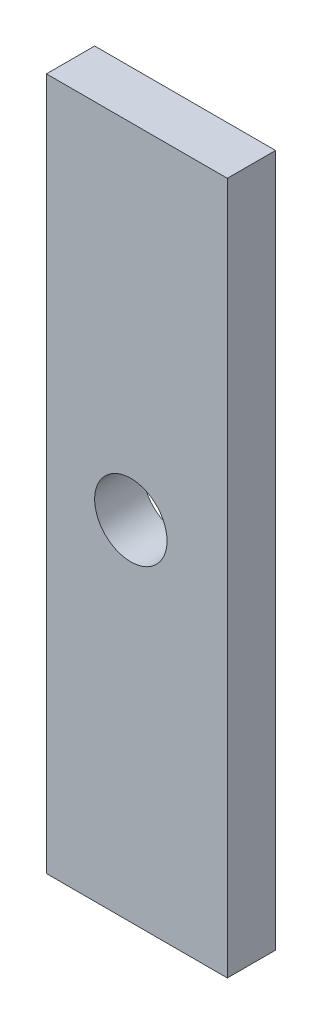
ISO-10303-21;
HEADER;
FILE_DESCRIPTION(('STEP AP214'),'2;1');
FILE_NAME('part.step','',(''),(''),'','','');
FILE_SCHEMA(('AUTOMOTIVE_DESIGN { 1 0 10303 214 1 1 1 1 }'));
ENDSEC;
DATA;
#1=APPLICATION_CONTEXT('core data for automotive mechanical design processes');
#2=APPLICATION_PROTOCOL_DEFINITION('international standard','automotive_design',2000,#1);
#3=PRODUCT_CONTEXT('',#1,'mechanical');
#4=PRODUCT('Part','Part','',(#3));
#5=PRODUCT_RELATED_PRODUCT_CATEGORY('part','',(#4));
#6=PRODUCT_DEFINITION_FORMATION('','',#4);
#7=PRODUCT_DEFINITION_CONTEXT('part definition',#1,'design');
#8=PRODUCT_DEFINITION('design','',#6,#7);
#9=PRODUCT_DEFINITION_SHAPE('','',#8);
#10=(LENGTH_UNIT() NAMED_UNIT(*) SI_UNIT(.MILLI.,.METRE.));
#11=(NAMED_UNIT(*) PLANE_ANGLE_UNIT() SI_UNIT($,.RADIAN.));
#12=(NAMED_UNIT(*) SI_UNIT($,.STERADIAN.) SOLID_ANGLE_UNIT());
#13=UNCERTAINTY_MEASURE_WITH_UNIT(LENGTH_MEASURE(1.E-05),#10,'distance_accuracy_value','');
#14=(GEOMETRIC_REPRESENTATION_CONTEXT(3) GLOBAL_UNCERTAINTY_ASSIGNED_CONTEXT((#13)) GLOBAL_UNIT_ASSIGNED_CONTEXT((#10,
#11,#12)) REPRESENTATION_CONTEXT('',''));
#15=CARTESIAN_POINT('',(0.,0.,0.));
#16=DIRECTION('',(0.,0.,1.));
#17=DIRECTION('',(1.,0.,0.));
#18=AXIS2_PLACEMENT_3D('',#15,#16,#17);
#19=CARTESIAN_POINT('',(0.,0.,2.));
#20=DIRECTION('',(0.,0.,-1.));
#21=DIRECTION('',(-1.,0.,0.));
#22=AXIS2_PLACEMENT_3D('',#19,#20,#21);
#23=PLANE('',#22);
#24=DIRECTION('',(0.,1.,0.));
#25=VECTOR('',#24,1.);
#26=CARTESIAN_POINT('',(4.,-14.441,2.));
#27=LINE('',#26,#25);
#28=CARTESIAN_POINT('',(4.,-14.441,2.));
#29=VERTEX_POINT('',#28);
#30=CARTESIAN_POINT('',(4.,14.2719690936802,2.));
#31=VERTEX_POINT('',#30);
#32=EDGE_CURVE('E85',#29,#31,#27,.T.);
#33=ORIENTED_EDGE('',*,*,#32,.T.);
#34=DIRECTION('',(-1.,0.,0.));
#35=VECTOR('',#34,1.);
#36=CARTESIAN_POINT('',(-3.5,14.2719690936802,2.));
#37=LINE('',#36,#35);
#38=CARTESIAN_POINT('',(-3.5,14.2719690936802,2.));
#39=VERTEX_POINT('',#38);
#40=EDGE_CURVE('E80',#31,#39,#37,.T.);
#41=ORIENTED_EDGE('',*,*,#40,.T.);
#42=DIRECTION('',(0.,-1.,0.));
#43=VECTOR('',#42,1.);
#44=CARTESIAN_POINT('',(-3.5,14.2719690936802,2.));
#45=LINE('',#44,#43);
#46=CARTESIAN_POINT('',(-3.5,-14.441,2.));
#47=VERTEX_POINT('',#46);
#48=EDGE_CURVE('E83',#39,#47,#45,.T.);
#49=ORIENTED_EDGE('',*,*,#48,.T.);
#50=DIRECTION('',(1.,0.,0.));
#51=VECTOR('',#50,1.);
#52=CARTESIAN_POINT('',(-3.5,-14.441,2.));
#53=LINE('',#52,#51);
#54=EDGE_CURVE('E50',#47,#29,#53,.T.);
#55=ORIENTED_EDGE('',*,*,#54,.T.);
#56=EDGE_LOOP('',(#33,#41,#49,#55));
#57=FACE_BOUND('',#56,.T.);
#58=CARTESIAN_POINT('',(0.,0.,2.));
#59=DIRECTION('',(0.,0.,1.));
#60=DIRECTION('',(1.,0.,0.));
#61=AXIS2_PLACEMENT_3D('',#58,#59,#60);
#62=CIRCLE('',#61,1.5);
#63=CARTESIAN_POINT('',(1.5,0.,2.));
#64=VERTEX_POINT('',#63);
#65=EDGE_CURVE('E100',#64,#64,#62,.T.);
#66=ORIENTED_EDGE('',*,*,#65,.F.);
#67=EDGE_LOOP('',(#66));
#68=FACE_BOUND('',#67,.T.);
#69=ADVANCED_FACE('F33',(#57,#68),#23,.F.);
#70=CARTESIAN_POINT('',(0.,0.,0.));
#71=DIRECTION('',(0.,0.,-1.));
#72=DIRECTION('',(-1.,0.,0.));
#73=AXIS2_PLACEMENT_3D('',#70,#71,#72);
#74=PLANE('',#73);
#75=DIRECTION('',(0.,1.,0.));
#76=VECTOR('',#75,1.);
#77=CARTESIAN_POINT('',(4.,-14.441,0.));
#78=LINE('',#77,#76);
#79=CARTESIAN_POINT('',(4.,-14.441,0.));
#80=VERTEX_POINT('',#79);
#81=CARTESIAN_POINT('',(4.,14.2719690936802,0.));
#82=VERTEX_POINT('',#81);
#83=EDGE_CURVE('E97',#80,#82,#78,.T.);
#84=ORIENTED_EDGE('',*,*,#83,.F.);
#85=DIRECTION('',(1.,0.,0.));
#86=VECTOR('',#85,1.);
#87=CARTESIAN_POINT('',(-3.5,-14.441,0.));
#88=LINE('',#87,#86);
#89=CARTESIAN_POINT('',(-3.5,-14.441,0.));
#90=VERTEX_POINT('',#89);
#91=EDGE_CURVE('E73',#90,#80,#88,.T.);
#92=ORIENTED_EDGE('',*,*,#91,.F.);
#93=DIRECTION('',(0.,-1.,0.));
#94=VECTOR('',#93,1.);
#95=CARTESIAN_POINT('',(-3.5,14.2719690936802,0.));
#96=LINE('',#95,#94);
#97=CARTESIAN_POINT('',(-3.5,14.2719690936802,0.));
#98=VERTEX_POINT('',#97);
#99=EDGE_CURVE('E67',#98,#90,#96,.T.);
#100=ORIENTED_EDGE('',*,*,#99,.F.);
#101=DIRECTION('',(-1.,0.,0.));
#102=VECTOR('',#101,1.);
#103=CARTESIAN_POINT('',(-3.5,14.2719690936802,0.));
#104=LINE('',#103,#102);
#105=EDGE_CURVE('E89',#82,#98,#104,.T.);
#106=ORIENTED_EDGE('',*,*,#105,.F.);
#107=EDGE_LOOP('',(#84,#92,#100,#106));
#108=FACE_BOUND('',#107,.T.);
#109=CARTESIAN_POINT('',(0.,0.,0.));
#110=DIRECTION('',(0.,0.,1.));
#111=DIRECTION('',(1.,0.,0.));
#112=AXIS2_PLACEMENT_3D('',#109,#110,#111);
#113=CIRCLE('',#112,1.5);
#114=CARTESIAN_POINT('',(1.5,0.,0.));
#115=VERTEX_POINT('',#114);
#116=EDGE_CURVE('E112',#115,#115,#113,.T.);
#117=ORIENTED_EDGE('',*,*,#116,.T.);
#118=EDGE_LOOP('',(#117));
#119=FACE_BOUND('',#118,.T.);
#120=ADVANCED_FACE('F108',(#108,#119),#74,.T.);
#121=CARTESIAN_POINT('',(4.,-14.441,2.));
#122=DIRECTION('',(-1.,0.,0.));
#123=DIRECTION('',(0.,-1.,0.));
#124=AXIS2_PLACEMENT_3D('',#121,#122,#123);
#125=PLANE('',#124);
#126=ORIENTED_EDGE('',*,*,#83,.T.);
#127=DIRECTION('',(0.,0.,-1.));
#128=VECTOR('',#127,1.);
#129=CARTESIAN_POINT('',(4.,14.2719690936802,2.));
#130=LINE('',#129,#128);
#131=EDGE_CURVE('E11',#31,#82,#130,.T.);
#132=ORIENTED_EDGE('',*,*,#131,.F.);
#133=ORIENTED_EDGE('',*,*,#32,.F.);
#134=DIRECTION('',(0.,0.,-1.));
#135=VECTOR('',#134,1.);
#136=CARTESIAN_POINT('',(4.,-14.441,2.));
#137=LINE('',#136,#135);
#138=EDGE_CURVE('E93',#29,#80,#137,.T.);
#139=ORIENTED_EDGE('',*,*,#138,.T.);
#140=EDGE_LOOP('',(#126,#132,#133,#139));
#141=FACE_BOUND('',#140,.T.);
#142=ADVANCED_FACE('F35',(#141),#125,.F.);
#143=CARTESIAN_POINT('',(-3.5,14.2719690936802,2.));
#144=DIRECTION('',(0.,-1.,0.));
#145=DIRECTION('',(0.,0.,-1.));
#146=AXIS2_PLACEMENT_3D('',#143,#144,#145);
#147=PLANE('',#146);
#148=ORIENTED_EDGE('',*,*,#105,.T.);
#149=DIRECTION('',(0.,0.,-1.));
#150=VECTOR('',#149,1.);
#151=CARTESIAN_POINT('',(-3.5,14.2719690936802,2.));
#152=LINE('',#151,#150);
#153=EDGE_CURVE('E42',#39,#98,#152,.T.);
#154=ORIENTED_EDGE('',*,*,#153,.F.);
#155=ORIENTED_EDGE('',*,*,#40,.F.);
#156=ORIENTED_EDGE('',*,*,#131,.T.);
#157=EDGE_LOOP('',(#148,#154,#155,#156));
#158=FACE_BOUND('',#157,.T.);
#159=ADVANCED_FACE('F88',(#158),#147,.F.);
#160=CARTESIAN_POINT('',(-3.5,14.2719690936802,2.));
#161=DIRECTION('',(1.,0.,0.));
#162=DIRECTION('',(0.,1.,0.));
#163=AXIS2_PLACEMENT_3D('',#160,#161,#162);
#164=PLANE('',#163);
#165=ORIENTED_EDGE('',*,*,#99,.T.);
#166=DIRECTION('',(0.,0.,-1.));
#167=VECTOR('',#166,1.);
#168=CARTESIAN_POINT('',(-3.5,-14.441,2.));
#169=LINE('',#168,#167);
#170=EDGE_CURVE('E90',#47,#90,#169,.T.);
#171=ORIENTED_EDGE('',*,*,#170,.F.);
#172=ORIENTED_EDGE('',*,*,#48,.F.);
#173=ORIENTED_EDGE('',*,*,#153,.T.);
#174=EDGE_LOOP('',(#165,#171,#172,#173));
#175=FACE_BOUND('',#174,.T.);
#176=ADVANCED_FACE('F91',(#175),#164,.F.);
#177=CARTESIAN_POINT('',(-3.5,-14.441,2.));
#178=DIRECTION('',(0.,1.,0.));
#179=DIRECTION('',(0.,0.,1.));
#180=AXIS2_PLACEMENT_3D('',#177,#178,#179);
#181=PLANE('',#180);
#182=ORIENTED_EDGE('',*,*,#91,.T.);
#183=ORIENTED_EDGE('',*,*,#138,.F.);
#184=ORIENTED_EDGE('',*,*,#54,.F.);
#185=ORIENTED_EDGE('',*,*,#170,.T.);
#186=EDGE_LOOP('',(#182,#183,#184,#185));
#187=FACE_BOUND('',#186,.T.);
#188=ADVANCED_FACE('F105',(#187),#181,.F.);
#189=CARTESIAN_POINT('',(0.,0.,2.));
#190=DIRECTION('',(0.,0.,-1.));
#191=DIRECTION('',(-1.,0.,0.));
#192=AXIS2_PLACEMENT_3D('',#189,#190,#191);
#193=CYLINDRICAL_SURFACE('',#192,1.5);
#194=ORIENTED_EDGE('',*,*,#65,.T.);
#195=EDGE_LOOP('',(#194));
#196=FACE_BOUND('',#195,.T.);
#197=ORIENTED_EDGE('',*,*,#116,.F.);
#198=EDGE_LOOP('',(#197));
#199=FACE_BOUND('',#198,.T.);
#200=ADVANCED_FACE('F118',(#196,#199),#193,.F.);
#201=CLOSED_SHELL('',(#69,#120,#142,#159,#176,#188,#200));
#202=MANIFOLD_SOLID_BREP('B2',#201);
#203=ADVANCED_BREP_SHAPE_REPRESENTATION('',(#18,#202),#14);
#204=SHAPE_DEFINITION_REPRESENTATION(#9,#203);
ENDSEC;
END-ISO-10303-21;
